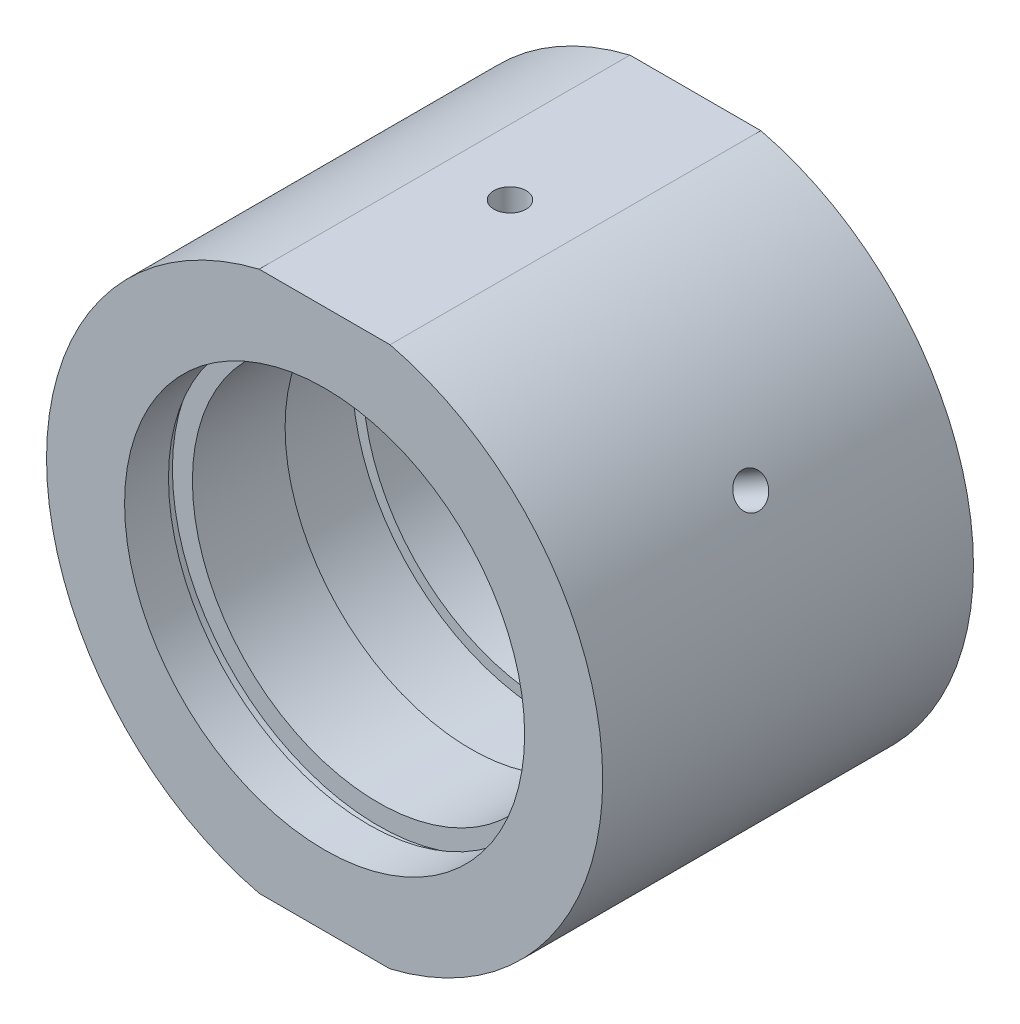
ISO-10303-21;
HEADER;
FILE_DESCRIPTION(('STEP AP214'),'2;1');
FILE_NAME('part.step','',(''),(''),'','','');
FILE_SCHEMA(('AUTOMOTIVE_DESIGN { 1 0 10303 214 1 1 1 1 }'));
ENDSEC;
DATA;
#1=APPLICATION_CONTEXT('core data for automotive mechanical design processes');
#2=APPLICATION_PROTOCOL_DEFINITION('international standard','automotive_design',2000,#1);
#3=PRODUCT_CONTEXT('',#1,'mechanical');
#4=PRODUCT('Part','Part','',(#3));
#5=PRODUCT_RELATED_PRODUCT_CATEGORY('part','',(#4));
#6=PRODUCT_DEFINITION_FORMATION('','',#4);
#7=PRODUCT_DEFINITION_CONTEXT('part definition',#1,'design');
#8=PRODUCT_DEFINITION('design','',#6,#7);
#9=PRODUCT_DEFINITION_SHAPE('','',#8);
#10=(LENGTH_UNIT() NAMED_UNIT(*) SI_UNIT(.MILLI.,.METRE.));
#11=(NAMED_UNIT(*) PLANE_ANGLE_UNIT() SI_UNIT($,.RADIAN.));
#12=(NAMED_UNIT(*) SI_UNIT($,.STERADIAN.) SOLID_ANGLE_UNIT());
#13=UNCERTAINTY_MEASURE_WITH_UNIT(LENGTH_MEASURE(1.E-05),#10,'distance_accuracy_value','');
#14=(GEOMETRIC_REPRESENTATION_CONTEXT(3) GLOBAL_UNCERTAINTY_ASSIGNED_CONTEXT((#13)) GLOBAL_UNIT_ASSIGNED_CONTEXT((#10,
#11,#12)) REPRESENTATION_CONTEXT('',''));
#15=CARTESIAN_POINT('',(0.,0.,0.));
#16=DIRECTION('',(0.,0.,1.));
#17=DIRECTION('',(1.,0.,0.));
#18=AXIS2_PLACEMENT_3D('',#15,#16,#17);
#19=CARTESIAN_POINT('',(-33.1519726534682,27.7,-30.));
#20=DIRECTION('',(0.,-1.,0.));
#21=DIRECTION('',(0.,0.,-1.));
#22=AXIS2_PLACEMENT_3D('',#19,#20,#21);
#23=PLANE('',#22);
#24=DIRECTION('',(-1.,0.,0.));
#25=VECTOR('',#24,1.);
#26=CARTESIAN_POINT('',(28.5,27.7,19.));
#27=LINE('',#26,#25);
#28=CARTESIAN_POINT('',(6.7052218456961,27.7,19.));
#29=VERTEX_POINT('',#28);
#30=CARTESIAN_POINT('',(-6.70522184569609,27.7,19.));
#31=VERTEX_POINT('',#30);
#32=EDGE_CURVE('E210',#29,#31,#27,.T.);
#33=ORIENTED_EDGE('',*,*,#32,.F.);
#34=DIRECTION('',(0.,0.,-1.));
#35=VECTOR('',#34,1.);
#36=CARTESIAN_POINT('',(6.70522184569613,27.7,-31.9390681003584));
#37=LINE('',#36,#35);
#38=CARTESIAN_POINT('',(6.70522184569614,27.7,-19.));
#39=VERTEX_POINT('',#38);
#40=EDGE_CURVE('E135',#39,#29,#37,.F.);
#41=ORIENTED_EDGE('',*,*,#40,.F.);
#42=DIRECTION('',(1.,0.,0.));
#43=VECTOR('',#42,1.);
#44=CARTESIAN_POINT('',(20.5,27.7,-19.));
#45=LINE('',#44,#43);
#46=CARTESIAN_POINT('',(-6.70522184569611,27.7,-19.));
#47=VERTEX_POINT('',#46);
#48=EDGE_CURVE('E139',#47,#39,#45,.T.);
#49=ORIENTED_EDGE('',*,*,#48,.F.);
#50=DIRECTION('',(0.,0.,-1.));
#51=VECTOR('',#50,1.);
#52=CARTESIAN_POINT('',(-6.70522184569613,27.7,-31.9390681003584));
#53=LINE('',#52,#51);
#54=EDGE_CURVE('E142',#31,#47,#53,.T.);
#55=ORIENTED_EDGE('',*,*,#54,.F.);
#56=EDGE_LOOP('',(#33,#41,#49,#55));
#57=FACE_BOUND('',#56,.T.);
#58=CARTESIAN_POINT('',(0.,27.7,0.));
#59=DIRECTION('',(0.,1.,0.));
#60=DIRECTION('',(0.,0.,1.));
#61=AXIS2_PLACEMENT_3D('',#58,#59,#60);
#62=CIRCLE('',#61,1.64999999999999);
#63=CARTESIAN_POINT('',(0.,27.7,1.64999999999999));
#64=VERTEX_POINT('',#63);
#65=EDGE_CURVE('E108',#64,#64,#62,.T.);
#66=ORIENTED_EDGE('',*,*,#65,.F.);
#67=EDGE_LOOP('',(#66));
#68=FACE_BOUND('',#67,.T.);
#69=ADVANCED_FACE('F44',(#57,#68),#23,.F.);
#70=CARTESIAN_POINT('',(0.,0.,-31.9390681003584));
#71=DIRECTION('',(0.,0.,-1.));
#72=DIRECTION('',(-1.,0.,0.));
#73=AXIS2_PLACEMENT_3D('',#70,#71,#72);
#74=CYLINDRICAL_SURFACE('',#73,28.5);
#75=CARTESIAN_POINT('',(23.8153251804841,15.6550402921169,0.));
#76=CARTESIAN_POINT('',(23.8153277749308,15.6550370795243,-0.092597859420851));
#77=CARTESIAN_POINT('',(23.8196314005314,15.648495501609,-0.185260883687119));
#78=CARTESIAN_POINT('',(23.8367053720121,15.6224745102445,-0.368029223496934));
#79=CARTESIAN_POINT('',(23.8494856204936,15.6029799647694,-0.458131418877639));
#80=CARTESIAN_POINT('',(23.883047908846,15.5515581135897,-0.633104162038933));
#81=CARTESIAN_POINT('',(23.9038257819432,15.5196372818995,-0.717977407442436));
#82=CARTESIAN_POINT('',(23.9526385469314,15.4441935848521,-0.880112571888857));
#83=CARTESIAN_POINT('',(23.9806717568717,15.4006734084152,-0.957376249277916));
#84=CARTESIAN_POINT('',(24.0430562144596,15.3030975605881,-1.10222274019426));
#85=CARTESIAN_POINT('',(24.0774147044993,15.249029808035,-1.16979429691297));
#86=CARTESIAN_POINT('',(24.1512594901974,15.1318027254734,-1.29324222428016));
#87=CARTESIAN_POINT('',(24.1907459978167,15.0686430196475,-1.34911811125169));
#88=CARTESIAN_POINT('',(24.2735675116473,14.9348620430341,-1.44762184788487));
#89=CARTESIAN_POINT('',(24.3169051374035,14.8642356871119,-1.49024058992059));
#90=CARTESIAN_POINT('',(24.4060146047625,14.7174662889455,-1.56096188486543));
#91=CARTESIAN_POINT('',(24.4517864233173,14.6413232989326,-1.5890645751916));
#92=CARTESIAN_POINT('',(24.5442958347122,14.485707503826,-1.62992536658154));
#93=CARTESIAN_POINT('',(24.5910322755923,14.4062385658194,-1.64270080242911));
#94=CARTESIAN_POINT('',(24.6841374618097,14.2461199296046,-1.65259795617058));
#95=CARTESIAN_POINT('',(24.7305062107939,14.1654702431304,-1.64971982952273));
#96=CARTESIAN_POINT('',(24.8215140418881,14.0053886164006,-1.62840588898168));
#97=CARTESIAN_POINT('',(24.8661551305039,13.9259553324555,-1.60998872611445));
#98=CARTESIAN_POINT('',(24.9525779635914,13.7705035188194,-1.55814843979012));
#99=CARTESIAN_POINT('',(24.9943596930856,13.6944850070158,-1.52472523773762));
#100=CARTESIAN_POINT('',(25.074039297685,13.5480446573406,-1.4438004575266));
#101=CARTESIAN_POINT('',(25.1119348175524,13.4776262191303,-1.39629040910615));
#102=CARTESIAN_POINT('',(25.1829180740113,13.3445245637642,-1.28854674262332));
#103=CARTESIAN_POINT('',(25.216005764436,13.2818414208868,-1.2283130023963));
#104=CARTESIAN_POINT('',(25.276680390478,13.1660062212325,-1.0967263901019));
#105=CARTESIAN_POINT('',(25.3042591835338,13.1128682844896,-1.02535733248248));
#106=CARTESIAN_POINT('',(25.3532699045685,13.0178559055621,-0.873582757263184));
#107=CARTESIAN_POINT('',(25.3747018304519,12.9759814672176,-0.793177236582501));
#108=CARTESIAN_POINT('',(25.4109837632356,12.9047862721655,-0.625601997467239));
#109=CARTESIAN_POINT('',(25.4258334645658,12.8754660982736,-0.538431965220726));
#110=CARTESIAN_POINT('',(25.4486562491563,12.8302977764119,-0.35980676827847));
#111=CARTESIAN_POINT('',(25.4566294017861,12.8144494925396,-0.268351646819872));
#112=CARTESIAN_POINT('',(25.465538390234,12.7967360980451,-0.0838944493383069));
#113=CARTESIAN_POINT('',(25.4664844223332,12.794850727388,0.00910518900747123));
#114=CARTESIAN_POINT('',(25.4613479608896,12.8050689748372,0.194136416173909));
#115=CARTESIAN_POINT('',(25.4552654986569,12.8171725306264,0.286168009305118));
#116=CARTESIAN_POINT('',(25.4361958173778,12.8549751225273,0.466586842761185));
#117=CARTESIAN_POINT('',(25.4232133159397,12.880664869599,0.554976528647749));
#118=CARTESIAN_POINT('',(25.3905999866401,12.9448337250359,0.725677915191171));
#119=CARTESIAN_POINT('',(25.3709691070619,12.9833129328883,0.80798956856187));
#120=CARTESIAN_POINT('',(25.325426555806,13.0719258258635,0.964302442341511));
#121=CARTESIAN_POINT('',(25.299507674783,13.1220728857392,1.03829397999782));
#122=CARTESIAN_POINT('',(25.2419427594548,13.2324672925696,1.17576878931791));
#123=CARTESIAN_POINT('',(25.2102966767578,13.2927147248668,1.23925197218311));
#124=CARTESIAN_POINT('',(25.1419318668708,13.4215713534383,1.35398434922265));
#125=CARTESIAN_POINT('',(25.1052071503995,13.490190411028,1.40521890087996));
#126=CARTESIAN_POINT('',(25.0275705469147,13.6336846873921,1.49389949694828));
#127=CARTESIAN_POINT('',(24.9866586827456,13.7085598720337,1.53134561658169));
#128=CARTESIAN_POINT('',(24.9016885882841,13.8623089314004,1.59136086739739));
#129=CARTESIAN_POINT('',(24.8576323454282,13.9411802713268,1.61393930515066));
#130=CARTESIAN_POINT('',(24.7675098427044,14.1006681486337,1.64360873795478));
#131=CARTESIAN_POINT('',(24.7214435992881,14.1812846717273,1.65069985974244));
#132=CARTESIAN_POINT('',(24.6286511043687,14.3418314405987,1.64919216160151));
#133=CARTESIAN_POINT('',(24.5819259168648,14.4217625177426,1.64061627710614));
#134=CARTESIAN_POINT('',(24.4891127337376,14.578809299921,1.60806550316041));
#135=CARTESIAN_POINT('',(24.4430247392691,14.6559249998534,1.58409058580486));
#136=CARTESIAN_POINT('',(24.3528909190879,14.805212368933,1.52142731292838));
#137=CARTESIAN_POINT('',(24.3088450919138,14.8773840416183,1.48273896793731));
#138=CARTESIAN_POINT('',(24.2241909586552,15.014829187217,1.39175049167336));
#139=CARTESIAN_POINT('',(24.1835825570162,15.0801028518958,1.33945073893903));
#140=CARTESIAN_POINT('',(24.1070787364025,15.2021036707577,1.22264007363981));
#141=CARTESIAN_POINT('',(24.071189757745,15.2588191613504,1.15811276186068));
#142=CARTESIAN_POINT('',(24.0053942654022,15.3621225072457,1.01869728937212));
#143=CARTESIAN_POINT('',(23.9754892210139,15.4087078754379,0.943806591650796));
#144=CARTESIAN_POINT('',(23.9226815656073,15.4905677684456,0.78571519859832));
#145=CARTESIAN_POINT('',(23.8997869013468,15.5258294592687,0.702505213408071));
#146=CARTESIAN_POINT('',(23.8618810776424,15.5840254408833,0.530265646202624));
#147=CARTESIAN_POINT('',(23.846860654162,15.6069742185544,0.441243042086118));
#148=CARTESIAN_POINT('',(23.8291633179954,15.6339733166283,0.293060355475163));
#149=CARTESIAN_POINT('',(23.82398218144,15.6418641270648,0.234858919179985));
#150=CARTESIAN_POINT('',(23.8170622895183,15.6523986335215,0.11778044436587));
#151=CARTESIAN_POINT('',(23.815323530103,15.6550423357132,0.0589034066416477));
#152=CARTESIAN_POINT('',(23.8153251804841,15.6550402921169,0.));
#153=B_SPLINE_CURVE_WITH_KNOTS('',3,(#75,#76,#77,#78,#79,#80,#81,#82,#83,#84,#85,#86,#87,#88,
#89,#90,#91,#92,#93,#94,#95,#96,#97,#98,#99,#100,#101,#102,#103,#104,#105,#106,#107,#108,#109,
#110,#111,#112,#113,#114,#115,#116,#117,#118,#119,#120,#121,#122,#123,#124,#125,#126,#127,#128,
#129,#130,#131,#132,#133,#134,#135,#136,#137,#138,#139,#140,#141,#142,#143,#144,#145,#146,#147,
#148,#149,#150,#151,#152),.UNSPECIFIED.,.T.,.F.,(4,2,2,2,2,2,2,2,2,2,2,2,2,2,2,2,2,2,2,2,2,2,2,
2,2,2,2,2,2,2,2,2,2,2,2,2,2,2,4),(0.,0.277578549691203,0.555481946042686,0.833240749883357,
1.11093522055068,1.38894964922939,1.66697557298441,1.94519208016563,2.22340595354618,
2.50130487570952,2.77920103801549,3.05676412385137,3.33432866346456,3.61206043913668,
3.88979488153024,4.16793684700295,4.44607890730275,4.72423387859202,5.00238604386324,
5.28013453415685,5.55788178715731,5.83543938610869,6.11299914418812,6.39087864776977,
6.66876049939252,6.94697289965536,7.22518378211567,7.50322034978582,7.78125464220031,
8.05888223740868,8.33651033571792,8.61413823533925,8.8917584148457,9.16975359929353,
9.44781695923019,9.72619436646001,10.0042435237498,10.1808171672527,10.3573906030721),.UNSPECIFIED.);
#154=CARTESIAN_POINT('',(23.8153251804841,15.6550402921169,0.));
#155=VERTEX_POINT('',#154);
#156=EDGE_CURVE('E11',#155,#155,#153,.T.);
#157=ORIENTED_EDGE('',*,*,#156,.T.);
#158=EDGE_LOOP('',(#157));
#159=FACE_BOUND('',#158,.T.);
#160=CARTESIAN_POINT('',(0.,0.,19.));
#161=DIRECTION('',(0.,0.,-1.));
#162=DIRECTION('',(-1.,0.,0.));
#163=AXIS2_PLACEMENT_3D('',#160,#161,#162);
#164=CIRCLE('',#163,28.5);
#165=CARTESIAN_POINT('',(6.7052218456961,-27.7,19.));
#166=VERTEX_POINT('',#165);
#167=EDGE_CURVE('E201',#29,#166,#164,.T.);
#168=ORIENTED_EDGE('',*,*,#167,.T.);
#169=DIRECTION('',(0.,0.,-1.));
#170=VECTOR('',#169,1.);
#171=CARTESIAN_POINT('',(6.70522184569613,-27.7,-31.9390681003584));
#172=LINE('',#171,#170);
#173=CARTESIAN_POINT('',(6.70522184569611,-27.7,-19.));
#174=VERTEX_POINT('',#173);
#175=EDGE_CURVE('E65',#166,#174,#172,.T.);
#176=ORIENTED_EDGE('',*,*,#175,.T.);
#177=CARTESIAN_POINT('',(0.,0.,-19.));
#178=DIRECTION('',(0.,0.,-1.));
#179=DIRECTION('',(-1.,0.,0.));
#180=AXIS2_PLACEMENT_3D('',#177,#178,#179);
#181=CIRCLE('',#180,28.5);
#182=EDGE_CURVE('E206',#39,#174,#181,.T.);
#183=ORIENTED_EDGE('',*,*,#182,.F.);
#184=ORIENTED_EDGE('',*,*,#40,.T.);
#185=EDGE_LOOP('',(#168,#176,#183,#184));
#186=FACE_BOUND('',#185,.T.);
#187=ADVANCED_FACE('F275',(#159,#186),#74,.T.);
#188=CARTESIAN_POINT('',(20.5,0.,-19.));
#189=DIRECTION('',(0.,0.,1.));
#190=DIRECTION('',(1.,0.,0.));
#191=AXIS2_PLACEMENT_3D('',#188,#189,#190);
#192=PLANE('',#191);
#193=CARTESIAN_POINT('',(0.,0.,-19.));
#194=DIRECTION('',(0.,0.,-1.));
#195=DIRECTION('',(-1.,0.,0.));
#196=AXIS2_PLACEMENT_3D('',#193,#194,#195);
#197=CIRCLE('',#196,20.5);
#198=CARTESIAN_POINT('',(-20.5,0.,-19.));
#199=VERTEX_POINT('',#198);
#200=EDGE_CURVE('E145',#199,#199,#197,.T.);
#201=ORIENTED_EDGE('',*,*,#200,.F.);
#202=EDGE_LOOP('',(#201));
#203=FACE_BOUND('',#202,.T.);
#204=ORIENTED_EDGE('',*,*,#182,.T.);
#205=DIRECTION('',(-1.,0.,0.));
#206=VECTOR('',#205,1.);
#207=CARTESIAN_POINT('',(20.5,-27.7,-19.));
#208=LINE('',#207,#206);
#209=CARTESIAN_POINT('',(-6.70522184569613,-27.7,-19.));
#210=VERTEX_POINT('',#209);
#211=EDGE_CURVE('E129',#174,#210,#208,.T.);
#212=ORIENTED_EDGE('',*,*,#211,.T.);
#213=EDGE_CURVE('E205',#210,#47,#181,.T.);
#214=ORIENTED_EDGE('',*,*,#213,.T.);
#215=ORIENTED_EDGE('',*,*,#48,.T.);
#216=EDGE_LOOP('',(#204,#212,#214,#215));
#217=FACE_BOUND('',#216,.T.);
#218=ADVANCED_FACE('F46',(#203,#217),#192,.F.);
#219=CARTESIAN_POINT('',(-25.4653251804841,12.7971564596282,0.));
#220=CARTESIAN_POINT('',(-25.4653236955207,12.7971603127813,-0.0925978594208509));
#221=CARTESIAN_POINT('',(-25.4618103356655,12.8041581508374,-0.185260883687119));
#222=CARTESIAN_POINT('',(-25.4478124818525,12.8319551395655,-0.368029223496933));
#223=CARTESIAN_POINT('',(-25.4373198344766,12.8527704321546,-0.458131418877638));
#224=CARTESIAN_POINT('',(-25.4095683492215,12.9075471520668,-0.633104162038933));
#225=CARTESIAN_POINT('',(-25.3923130346165,12.9415017338507,-0.717977407442436));
#226=CARTESIAN_POINT('',(-25.3513832589122,13.0214966768832,-0.880112571888858));
#227=CARTESIAN_POINT('',(-25.3277102855108,13.0675342370595,-0.957376249277916));
#228=CARTESIAN_POINT('',(-25.2743993512906,13.1703486860455,-1.10222274019426));
#229=CARTESIAN_POINT('',(-25.2447545490739,13.2271378875321,-1.16979429691297));
#230=CARTESIAN_POINT('',(-25.1801553104131,13.3497028891645,-1.29324222428016));
#231=CARTESIAN_POINT('',(-25.145200654482,13.4154790607825,-1.34911811125169));
#232=CARTESIAN_POINT('',(-25.070753687107,13.5540950840463,-1.44762184788487));
#233=CARTESIAN_POINT('',(-25.0312582815798,13.626939746852,-1.49024058992059));
#234=CARTESIAN_POINT('',(-24.948706987949,13.7774955083858,-1.56096188486543));
#235=CARTESIAN_POINT('',(-24.9056511335551,13.8552065610382,-1.5890645751916));
#236=CARTESIAN_POINT('',(-24.8171386074601,14.0131299589486,-1.62992536658154));
#237=CARTESIAN_POINT('',(-24.7716847087747,14.0933393730365,-1.64270080242911));
#238=CARTESIAN_POINT('',(-24.679570495302,14.2540301476322,-1.65259795617058));
#239=CARTESIAN_POINT('',(-24.6329101925002,14.3345115054314,-1.64971982952273));
#240=CARTESIAN_POINT('',(-24.5397793526202,14.4933674124672,-1.62840588898168));
#241=CARTESIAN_POINT('',(-24.4933086551257,14.5717443712336,-1.60998872611445));
#242=CARTESIAN_POINT('',(-24.4018948519962,14.7243146469725,-1.55814843979012));
#243=CARTESIAN_POINT('',(-24.3569517543635,14.7985079420303,-1.52472523773762));
#244=CARTESIAN_POINT('',(-24.2699704937053,14.9407326786145,-1.4438004575266));
#245=CARTESIAN_POINT('',(-24.2279340972541,15.0087603806144,-1.39629040910615));
#246=CARTESIAN_POINT('',(-24.1481563106508,15.1367845116342,-1.28854674262332));
#247=CARTESIAN_POINT('',(-24.1104149617422,15.1967808635333,-1.2283130023963));
#248=CARTESIAN_POINT('',(-24.0404360492101,15.3072442308779,-1.0967263901019));
#249=CARTESIAN_POINT('',(-24.008206642614,15.3576971346413,-1.02535733248249));
#250=CARTESIAN_POINT('',(-23.9504288693062,15.447647853579,-0.873582757263184));
#251=CARTESIAN_POINT('',(-23.9248805048723,15.4871456650183,-0.7931772365825));
#252=CARTESIAN_POINT('',(-23.8813646237216,15.5541643380334,-0.625601997467238));
#253=CARTESIAN_POINT('',(-23.863397458953,15.5816846435699,-0.538431965220725));
#254=CARTESIAN_POINT('',(-23.8356919370697,15.6240339157413,-0.35980676827847));
#255=CARTESIAN_POINT('',(-23.8259534969448,15.6388630104031,-0.268351646819872));
#256=CARTESIAN_POINT('',(-23.8150677415492,15.6554351179682,-0.0838944493383072));
#257=CARTESIAN_POINT('',(-23.8139079787142,15.6571970911275,0.0091051890074712));
#258=CARTESIAN_POINT('',(-23.8201890098656,15.6476396613071,0.194136416173909));
#259=CARTESIAN_POINT('',(-23.8276297655388,15.6363203166015,0.286168009305118));
#260=CARTESIAN_POINT('',(-23.8508329298143,15.6009041922212,0.466586842761185));
#261=CARTESIAN_POINT('',(-23.8665896526762,15.5768161426353,0.554976528647749));
#262=CARTESIAN_POINT('',(-23.9058548469666,15.5164877432414,0.725677915191172));
#263=CARTESIAN_POINT('',(-23.9293633786951,15.4802472989019,0.807989568561871));
#264=CARTESIAN_POINT('',(-23.9833331194865,15.3964998460735,0.964302442341513));
#265=CARTESIAN_POINT('',(-24.0138023067524,15.3489799067321,1.03829397999782));
#266=CARTESIAN_POINT('',(-24.0806242098392,15.243930024276,1.17576878931791));
#267=CARTESIAN_POINT('',(-24.1169769753729,15.1863999965815,1.23925197218312));
#268=CARTESIAN_POINT('',(-24.1943876842183,15.0627660202087,1.35398434922265));
#269=CARTESIAN_POINT('',(-24.2354511730391,14.9966519540029,1.40521890087996));
#270=CARTESIAN_POINT('',(-24.3209025599257,14.8576695449395,1.49389949694828));
#271=CARTESIAN_POINT('',(-24.3652904398538,14.7848012389321,1.53134561658169));
#272=CARTESIAN_POINT('',(-24.4559559838425,14.6343404488831,1.59136086739739));
#273=CARTESIAN_POINT('',(-24.5022324464214,14.5567509534114,1.61393930515066));
#274=CARTESIAN_POINT('',(-24.5952917484029,14.3989586379466,1.64360873795478));
#275=CARTESIAN_POINT('',(-24.6420745836586,14.3187558393443,1.65069985974244));
#276=CARTESIAN_POINT('',(-24.734715916537,14.1581217970279,1.64919216160151));
#277=CARTESIAN_POINT('',(-24.7805756661436,14.077691059081,1.64061627710614));
#278=CARTESIAN_POINT('',(-24.8701755775291,13.9187890935975,1.60806550316041));
#279=CARTESIAN_POINT('',(-24.9139157354669,13.840317869612,1.58409058580486));
#280=CARTESIAN_POINT('',(-24.9981354794634,13.6876160070553,1.52142731292838));
#281=CARTESIAN_POINT('',(-25.0386150678554,13.6133853654491,1.48273896793731));
#282=CARTESIAN_POINT('',(-25.1153189889414,13.4713501627124,1.39175049167336));
#283=CARTESIAN_POINT('',(-25.1515434399318,13.4035454229466,1.33945073893903));
#284=CARTESIAN_POINT('',(-25.218947338042,13.2762907613776,1.22264007363981));
#285=CARTESIAN_POINT('',(-25.2501199043546,13.216852248848,1.15811276186068));
#286=CARTESIAN_POINT('',(-25.3066854800245,13.108220008077,1.01869728937212));
#287=CARTESIAN_POINT('',(-25.3320770701294,13.0590287958393,0.943806591650794));
#288=CARTESIAN_POINT('',(-25.3765659893218,12.972366078239,0.785715198598317));
#289=CARTESIAN_POINT('',(-25.3956561772248,12.9349078719668,0.702505213408068));
#290=CARTESIAN_POINT('',(-25.427102463849,12.8729824748801,0.530265646202622));
#291=CARTESIAN_POINT('',(-25.4394664765578,12.848500017735,0.441243042086116));
#292=CARTESIAN_POINT('',(-25.4539997132857,12.8196741259984,0.293060355475163));
#293=CARTESIAN_POINT('',(-25.4582427873025,12.8112417249027,0.234858919179985));
#294=CARTESIAN_POINT('',(-25.4639059915494,12.7999816694787,0.11778044436587));
#295=CARTESIAN_POINT('',(-25.4653261250999,12.7971540085582,0.0589034066416476));
#296=CARTESIAN_POINT('',(-25.4653251804841,12.7971564596282,0.));
#297=B_SPLINE_CURVE_WITH_KNOTS('',3,(#219,#220,#221,#222,#223,#224,#225,#226,#227,#228,#229,
#230,#231,#232,#233,#234,#235,#236,#237,#238,#239,#240,#241,#242,#243,#244,#245,#246,#247,#248,
#249,#250,#251,#252,#253,#254,#255,#256,#257,#258,#259,#260,#261,#262,#263,#264,#265,#266,#267,
#268,#269,#270,#271,#272,#273,#274,#275,#276,#277,#278,#279,#280,#281,#282,#283,#284,#285,#286,
#287,#288,#289,#290,#291,#292,#293,#294,#295,#296),.UNSPECIFIED.,.T.,.F.,(4,2,2,2,2,2,2,2,2,2,2,
2,2,2,2,2,2,2,2,2,2,2,2,2,2,2,2,2,2,2,2,2,2,2,2,2,2,2,4),(0.,0.277578549691203,
0.555481946042686,0.833240749883359,1.11093522055068,1.38894964922939,1.66697557298441,
1.94519208016563,2.22340595354617,2.50130487570952,2.77920103801548,3.05676412385137,
3.33432866346457,3.61206043913668,3.88979488153024,4.16793684700295,4.44607890730275,
4.72423387859202,5.00238604386324,5.28013453415685,5.55788178715731,5.83543938610869,
6.11299914418812,6.39087864776977,6.66876049939252,6.94697289965537,7.22518378211567,
7.50322034978582,7.78125464220031,8.05888223740868,8.33651033571792,8.61413823533925,
8.8917584148457,9.16975359929354,9.44781695923019,9.72619436646001,10.0042435237498,
10.1808171672527,10.3573906030721),.UNSPECIFIED.);
#298=CARTESIAN_POINT('',(-25.4653251804841,12.7971564596282,0.));
#299=VERTEX_POINT('',#298);
#300=EDGE_CURVE('E233',#299,#299,#297,.T.);
#301=ORIENTED_EDGE('',*,*,#300,.T.);
#302=EDGE_LOOP('',(#301));
#303=FACE_BOUND('',#302,.T.);
#304=ORIENTED_EDGE('',*,*,#213,.F.);
#305=DIRECTION('',(0.,0.,-1.));
#306=VECTOR('',#305,1.);
#307=CARTESIAN_POINT('',(-6.70522184569613,-27.7,-31.9390681003584));
#308=LINE('',#307,#306);
#309=CARTESIAN_POINT('',(-6.70522184569609,-27.7,19.));
#310=VERTEX_POINT('',#309);
#311=EDGE_CURVE('E126',#210,#310,#308,.F.);
#312=ORIENTED_EDGE('',*,*,#311,.T.);
#313=EDGE_CURVE('E73',#310,#31,#164,.T.);
#314=ORIENTED_EDGE('',*,*,#313,.T.);
#315=ORIENTED_EDGE('',*,*,#54,.T.);
#316=EDGE_LOOP('',(#304,#312,#314,#315));
#317=FACE_BOUND('',#316,.T.);
#318=ADVANCED_FACE('F218',(#303,#317),#74,.T.);
#319=CARTESIAN_POINT('',(28.5,0.,19.));
#320=DIRECTION('',(0.,0.,-1.));
#321=DIRECTION('',(-1.,0.,0.));
#322=AXIS2_PLACEMENT_3D('',#319,#320,#321);
#323=PLANE('',#322);
#324=ORIENTED_EDGE('',*,*,#313,.F.);
#325=DIRECTION('',(1.,0.,0.));
#326=VECTOR('',#325,1.);
#327=CARTESIAN_POINT('',(28.5,-27.7,19.));
#328=LINE('',#327,#326);
#329=EDGE_CURVE('E58',#310,#166,#328,.T.);
#330=ORIENTED_EDGE('',*,*,#329,.T.);
#331=ORIENTED_EDGE('',*,*,#167,.F.);
#332=ORIENTED_EDGE('',*,*,#32,.T.);
#333=EDGE_LOOP('',(#324,#330,#331,#332));
#334=FACE_BOUND('',#333,.T.);
#335=CARTESIAN_POINT('',(0.,0.,19.));
#336=DIRECTION('',(0.,0.,-1.));
#337=DIRECTION('',(-1.,0.,0.));
#338=AXIS2_PLACEMENT_3D('',#335,#336,#337);
#339=CIRCLE('',#338,20.5);
#340=CARTESIAN_POINT('',(-20.5,0.,19.));
#341=VERTEX_POINT('',#340);
#342=EDGE_CURVE('E197',#341,#341,#339,.T.);
#343=ORIENTED_EDGE('',*,*,#342,.T.);
#344=EDGE_LOOP('',(#343));
#345=FACE_BOUND('',#344,.T.);
#346=ADVANCED_FACE('F267',(#334,#345),#323,.F.);
#347=CARTESIAN_POINT('',(0.,0.,-31.9390681003584));
#348=DIRECTION('',(0.,0.,-1.));
#349=DIRECTION('',(-1.,0.,0.));
#350=AXIS2_PLACEMENT_3D('',#347,#348,#349);
#351=CYLINDRICAL_SURFACE('',#350,20.5);
#352=ORIENTED_EDGE('',*,*,#342,.F.);
#353=EDGE_LOOP('',(#352));
#354=FACE_BOUND('',#353,.T.);
#355=CARTESIAN_POINT('',(0.,0.,14.5));
#356=DIRECTION('',(0.,0.,-1.));
#357=DIRECTION('',(-1.,0.,0.));
#358=AXIS2_PLACEMENT_3D('',#355,#356,#357);
#359=CIRCLE('',#358,20.5);
#360=CARTESIAN_POINT('',(-20.5,0.,14.5));
#361=VERTEX_POINT('',#360);
#362=EDGE_CURVE('E193',#361,#361,#359,.T.);
#363=ORIENTED_EDGE('',*,*,#362,.T.);
#364=EDGE_LOOP('',(#363));
#365=FACE_BOUND('',#364,.T.);
#366=ADVANCED_FACE('F264',(#354,#365),#351,.F.);
#367=CARTESIAN_POINT('',(20.5,0.,14.5));
#368=DIRECTION('',(0.,0.,1.));
#369=DIRECTION('',(1.,0.,0.));
#370=AXIS2_PLACEMENT_3D('',#367,#368,#369);
#371=PLANE('',#370);
#372=ORIENTED_EDGE('',*,*,#362,.F.);
#373=EDGE_LOOP('',(#372));
#374=FACE_BOUND('',#373,.T.);
#375=CARTESIAN_POINT('',(0.,0.,14.5));
#376=DIRECTION('',(0.,0.,-1.));
#377=DIRECTION('',(-1.,0.,0.));
#378=AXIS2_PLACEMENT_3D('',#375,#376,#377);
#379=CIRCLE('',#378,21.1);
#380=CARTESIAN_POINT('',(-21.1,0.,14.5));
#381=VERTEX_POINT('',#380);
#382=EDGE_CURVE('E189',#381,#381,#379,.T.);
#383=ORIENTED_EDGE('',*,*,#382,.T.);
#384=EDGE_LOOP('',(#383));
#385=FACE_BOUND('',#384,.T.);
#386=ADVANCED_FACE('F260',(#374,#385),#371,.F.);
#387=CARTESIAN_POINT('',(0.,0.,-31.9390681003584));
#388=DIRECTION('',(0.,0.,-1.));
#389=DIRECTION('',(-1.,0.,0.));
#390=AXIS2_PLACEMENT_3D('',#387,#388,#389);
#391=CYLINDRICAL_SURFACE('',#390,21.1);
#392=ORIENTED_EDGE('',*,*,#382,.F.);
#393=EDGE_LOOP('',(#392));
#394=FACE_BOUND('',#393,.T.);
#395=CARTESIAN_POINT('',(0.,0.,13.5));
#396=DIRECTION('',(0.,0.,-1.));
#397=DIRECTION('',(-1.,0.,0.));
#398=AXIS2_PLACEMENT_3D('',#395,#396,#397);
#399=CIRCLE('',#398,21.1);
#400=CARTESIAN_POINT('',(-21.1,0.,13.5));
#401=VERTEX_POINT('',#400);
#402=EDGE_CURVE('E185',#401,#401,#399,.T.);
#403=ORIENTED_EDGE('',*,*,#402,.T.);
#404=EDGE_LOOP('',(#403));
#405=FACE_BOUND('',#404,.T.);
#406=ADVANCED_FACE('F256',(#394,#405),#391,.F.);
#407=CARTESIAN_POINT('',(21.1,0.,13.5));
#408=DIRECTION('',(0.,0.,-1.));
#409=DIRECTION('',(-1.,0.,0.));
#410=AXIS2_PLACEMENT_3D('',#407,#408,#409);
#411=PLANE('',#410);
#412=ORIENTED_EDGE('',*,*,#402,.F.);
#413=EDGE_LOOP('',(#412));
#414=FACE_BOUND('',#413,.T.);
#415=CARTESIAN_POINT('',(0.,0.,13.5));
#416=DIRECTION('',(0.,0.,-1.));
#417=DIRECTION('',(-1.,0.,0.));
#418=AXIS2_PLACEMENT_3D('',#415,#416,#417);
#419=CIRCLE('',#418,19.05);
#420=CARTESIAN_POINT('',(-19.05,0.,13.5));
#421=VERTEX_POINT('',#420);
#422=EDGE_CURVE('E181',#421,#421,#419,.T.);
#423=ORIENTED_EDGE('',*,*,#422,.T.);
#424=EDGE_LOOP('',(#423));
#425=FACE_BOUND('',#424,.T.);
#426=ADVANCED_FACE('F252',(#414,#425),#411,.F.);
#427=CARTESIAN_POINT('',(0.,0.,-31.9390681003584));
#428=DIRECTION('',(0.,0.,-1.));
#429=DIRECTION('',(-1.,0.,0.));
#430=AXIS2_PLACEMENT_3D('',#427,#428,#429);
#431=CYLINDRICAL_SURFACE('',#430,19.05);
#432=ORIENTED_EDGE('',*,*,#422,.F.);
#433=EDGE_LOOP('',(#432));
#434=FACE_BOUND('',#433,.T.);
#435=CARTESIAN_POINT('',(0.,0.,4.));
#436=DIRECTION('',(0.,0.,-1.));
#437=DIRECTION('',(-1.,0.,0.));
#438=AXIS2_PLACEMENT_3D('',#435,#436,#437);
#439=CIRCLE('',#438,19.05);
#440=CARTESIAN_POINT('',(-19.05,0.,4.));
#441=VERTEX_POINT('',#440);
#442=EDGE_CURVE('E177',#441,#441,#439,.T.);
#443=ORIENTED_EDGE('',*,*,#442,.T.);
#444=EDGE_LOOP('',(#443));
#445=FACE_BOUND('',#444,.T.);
#446=ADVANCED_FACE('F248',(#434,#445),#431,.F.);
#447=CARTESIAN_POINT('',(19.05,0.,4.));
#448=DIRECTION('',(0.,0.,1.));
#449=DIRECTION('',(1.,0.,0.));
#450=AXIS2_PLACEMENT_3D('',#447,#448,#449);
#451=PLANE('',#450);
#452=ORIENTED_EDGE('',*,*,#442,.F.);
#453=EDGE_LOOP('',(#452));
#454=FACE_BOUND('',#453,.T.);
#455=CARTESIAN_POINT('',(0.,0.,4.));
#456=DIRECTION('',(0.,0.,-1.));
#457=DIRECTION('',(-1.,0.,0.));
#458=AXIS2_PLACEMENT_3D('',#455,#456,#457);
#459=CIRCLE('',#458,20.15);
#460=CARTESIAN_POINT('',(-20.15,0.,4.));
#461=VERTEX_POINT('',#460);
#462=EDGE_CURVE('E173',#461,#461,#459,.T.);
#463=ORIENTED_EDGE('',*,*,#462,.T.);
#464=EDGE_LOOP('',(#463));
#465=FACE_BOUND('',#464,.T.);
#466=ADVANCED_FACE('F242',(#454,#465),#451,.F.);
#467=CARTESIAN_POINT('',(0.,0.,-31.9390681003584));
#468=DIRECTION('',(0.,0.,-1.));
#469=DIRECTION('',(-1.,0.,0.));
#470=AXIS2_PLACEMENT_3D('',#467,#468,#469);
#471=CYLINDRICAL_SURFACE('',#470,20.15);
#472=CARTESIAN_POINT('',(-18.216808416608,8.61222335477884,0.));
#473=CARTESIAN_POINT('',(-18.2168071717094,8.61222730548485,0.0925143759811275));
#474=CARTESIAN_POINT('',(-18.2134645141771,8.61930750036369,0.185091875761764));
#475=CARTESIAN_POINT('',(-18.2001329981117,8.64742109177869,0.367685787677287));
#476=CARTESIAN_POINT('',(-18.1901365926905,8.66847033236071,0.457699170479255));
#477=CARTESIAN_POINT('',(-18.1636511344035,8.7238302026295,0.632493822109133));
#478=CARTESIAN_POINT('',(-18.1471657423378,8.75813335484332,0.717278009877318));
#479=CARTESIAN_POINT('',(-18.1079671408111,8.83889308801043,0.879252633503249));
#480=CARTESIAN_POINT('',(-18.0852552701704,8.88534705619119,0.956444696980381));
#481=CARTESIAN_POINT('',(-18.0339280319583,8.98906475398761,1.10125591015014));
#482=CARTESIAN_POINT('',(-18.0052997781153,9.04635205578128,1.16885361129772));
#483=CARTESIAN_POINT('',(-17.9426947286032,9.16989593747247,1.29237302908199));
#484=CARTESIAN_POINT('',(-17.9087177002172,9.23615290760904,1.34829423744585));
#485=CARTESIAN_POINT('',(-17.8360505949508,9.37571264935142,1.44694431345598));
#486=CARTESIAN_POINT('',(-17.7973540094767,9.44902512092919,1.48965466893052));
#487=CARTESIAN_POINT('',(-17.71615157623,9.60040849311726,1.56055223096122));
#488=CARTESIAN_POINT('',(-17.673645793103,9.67847931296674,1.58873968392989));
#489=CARTESIAN_POINT('',(-17.585971954807,9.83688274702673,1.62972968782682));
#490=CARTESIAN_POINT('',(-17.5408101364341,9.91720984811717,1.64256688047848));
#491=CARTESIAN_POINT('',(-17.4489480772331,10.0779600723713,1.65259904373962));
#492=CARTESIAN_POINT('',(-17.4022478641434,10.1583831937785,1.64979429623333));
#493=CARTESIAN_POINT('',(-17.3087709252889,10.3168500072012,1.62865054494948));
#494=CARTESIAN_POINT('',(-17.2619946512654,10.3948989407572,1.6103487938979));
#495=CARTESIAN_POINT('',(-17.1696858574897,10.5466716150568,1.55878847073778));
#496=CARTESIAN_POINT('',(-17.1241533492294,10.6203953158442,1.52552976048227));
#497=CARTESIAN_POINT('',(-17.0357480498084,10.7616330359521,1.44495804026483));
#498=CARTESIAN_POINT('',(-16.9928784925394,10.8291395513177,1.39762833082311));
#499=CARTESIAN_POINT('',(-16.9113056730202,10.9560915943942,1.2902702557445));
#500=CARTESIAN_POINT('',(-16.8726024923454,11.015536964278,1.23024164153786));
#501=CARTESIAN_POINT('',(-16.8006169116254,11.1250207312329,1.09897975583741));
#502=CARTESIAN_POINT('',(-16.7673507543522,11.175031007829,1.02771411696017));
#503=CARTESIAN_POINT('',(-16.7075964564866,11.26417372941,0.876113998459199));
#504=CARTESIAN_POINT('',(-16.6811083212062,11.3033061658697,0.795779511728011));
#505=CARTESIAN_POINT('',(-16.6359098996425,11.369723999364,0.628299466842711));
#506=CARTESIAN_POINT('',(-16.6172005260964,11.3970080061549,0.541153110827992));
#507=CARTESIAN_POINT('',(-16.588292396553,11.4390433113809,0.362533859638642));
#508=CARTESIAN_POINT('',(-16.5780934678756,11.453794864104,0.27106105228904));
#509=CARTESIAN_POINT('',(-16.5666264189945,11.4703745561771,0.0866695714065173));
#510=CARTESIAN_POINT('',(-16.5653324746885,11.4722400646039,-0.00624413748201938));
#511=CARTESIAN_POINT('',(-16.571658226347,11.4631005104668,-0.19112953722204));
#512=CARTESIAN_POINT('',(-16.5792778420768,11.4520955637554,-0.283101236545444));
#513=CARTESIAN_POINT('',(-16.6031126207604,11.4175122856666,-0.463362054967364));
#514=CARTESIAN_POINT('',(-16.6193158372836,11.3939514290038,-0.551656108749796));
#515=CARTESIAN_POINT('',(-16.6596815979082,11.3348481371687,-0.722208109064252));
#516=CARTESIAN_POINT('',(-16.6838442653956,11.299305516257,-0.804465962000009));
#517=CARTESIAN_POINT('',(-16.7392778457669,11.2170198569593,-0.960817803887209));
#518=CARTESIAN_POINT('',(-16.7705649399965,11.1702513084095,-1.03489262939069));
#519=CARTESIAN_POINT('',(-16.8390628414066,11.0667206167782,-1.17258207217326));
#520=CARTESIAN_POINT('',(-16.8762737470404,11.0099583075996,-1.23619651556606));
#521=CARTESIAN_POINT('',(-16.9553896268597,10.8877254360478,-1.35131382461082));
#522=CARTESIAN_POINT('',(-16.9973056425382,10.8222343193818,-1.40278728338109));
#523=CARTESIAN_POINT('',(-17.0843153561747,10.6843486287101,-1.49195975216877));
#524=CARTESIAN_POINT('',(-17.1294090233146,10.6119541216537,-1.52965889575273));
#525=CARTESIAN_POINT('',(-17.2212299452127,10.4622861370419,-1.59016204030671));
#526=CARTESIAN_POINT('',(-17.2679551278308,10.3850187545063,-1.61298425948634));
#527=CARTESIAN_POINT('',(-17.3616267846109,10.227648626743,-1.64314526541811));
#528=CARTESIAN_POINT('',(-17.4085732547273,10.1475459331792,-1.65048433414953));
#529=CARTESIAN_POINT('',(-17.5011657040039,9.9870046181263,-1.64946746949103));
#530=CARTESIAN_POINT('',(-17.5468150853713,9.9065676644983,-1.64115738008657));
#531=CARTESIAN_POINT('',(-17.6357092429086,9.7474390997817,-1.60917364960808));
#532=CARTESIAN_POINT('',(-17.6789540157216,9.66874749112968,-1.58549998708729));
#533=CARTESIAN_POINT('',(-17.7619505791788,9.51541997828316,-1.52347267953603));
#534=CARTESIAN_POINT('',(-17.8017025552251,9.44078385889838,-1.48511981427629));
#535=CARTESIAN_POINT('',(-17.8768076529871,9.29778357104177,-1.39482810906678));
#536=CARTESIAN_POINT('',(-17.9121608477229,9.22941929846179,-1.34288949468586));
#537=CARTESIAN_POINT('',(-17.9778303120726,9.10084351047085,-1.22672863886547));
#538=CARTESIAN_POINT('',(-18.0081322433314,9.040655289942,-1.16247250716413));
#539=CARTESIAN_POINT('',(-18.0630136609571,8.93050029776728,-1.023561106385));
#540=CARTESIAN_POINT('',(-18.0875917585868,8.88053600704441,-0.948903320627931));
#541=CARTESIAN_POINT('',(-18.1306293354538,8.79233757990831,-0.791167730369249));
#542=CARTESIAN_POINT('',(-18.1490775802495,8.75412499077274,-0.708074826229334));
#543=CARTESIAN_POINT('',(-18.1794791263306,8.69081604268442,-0.535994481105062));
#544=CARTESIAN_POINT('',(-18.1914399063475,8.66570458206565,-0.447013960745675));
#545=CARTESIAN_POINT('',(-18.2056419434715,8.63581257429337,-0.297922429589514));
#546=CARTESIAN_POINT('',(-18.2098260656707,8.62697964916442,-0.238770704545334));
#547=CARTESIAN_POINT('',(-18.2154097016018,8.61518376819815,-0.119754803131207));
#548=CARTESIAN_POINT('',(-18.2168092225127,8.6122207972275,-0.0598906285984251));
#549=CARTESIAN_POINT('',(-18.216808416608,8.61222335477884,0.));
#550=B_SPLINE_CURVE_WITH_KNOTS('',3,(#472,#473,#474,#475,#476,#477,#478,#479,#480,#481,#482,
#483,#484,#485,#486,#487,#488,#489,#490,#491,#492,#493,#494,#495,#496,#497,#498,#499,#500,#501,
#502,#503,#504,#505,#506,#507,#508,#509,#510,#511,#512,#513,#514,#515,#516,#517,#518,#519,#520,
#521,#522,#523,#524,#525,#526,#527,#528,#529,#530,#531,#532,#533,#534,#535,#536,#537,#538,#539,
#540,#541,#542,#543,#544,#545,#546,#547,#548,#549),.UNSPECIFIED.,.T.,.F.,(4,2,2,2,2,2,2,2,2,2,2,
2,2,2,2,2,2,2,2,2,2,2,2,2,2,2,2,2,2,2,2,2,2,2,2,2,2,2,4),(0.,0.277324458665704,
0.554964004592898,0.832447142508944,1.10987066260477,1.38790492095644,1.66595127950104,
1.94438551338994,2.22281502288312,2.5006149930804,2.77840995704621,3.05553902863923,
3.3326706599321,3.61013251335774,3.88759979835448,4.16588141951653,4.44416325877568,
4.72247774161202,5.0007865772115,5.27828798683278,5.55578689856235,5.83290060535935,
6.11001860812509,6.38777240612831,6.66553082085528,6.94395524454924,7.22237696835027,
7.50045709452483,7.77853215625764,8.05579386807383,8.33305596693383,8.61030333945799,
8.88754610904115,9.16556292310789,9.44364712051112,9.72223819907526,10.000507432308,
10.1800382219741,10.3595685487915),.UNSPECIFIED.);
#551=CARTESIAN_POINT('',(-18.216808416608,8.61222335477884,0.));
#552=VERTEX_POINT('',#551);
#553=EDGE_CURVE('E48',#552,#552,#550,.T.);
#554=ORIENTED_EDGE('',*,*,#553,.T.);
#555=EDGE_LOOP('',(#554));
#556=FACE_BOUND('',#555,.T.);
#557=CARTESIAN_POINT('',(16.566808416608,11.4701071872675,0.));
#558=CARTESIAN_POINT('',(16.5668112155705,11.4701041338006,0.0925143759811275));
#559=CARTESIAN_POINT('',(16.5712715154332,11.4636692100221,0.185091875761764));
#560=CARTESIAN_POINT('',(16.5889528417575,11.438066982731,0.367685787677287));
#561=CARTESIAN_POINT('',(16.6021838161212,11.4188852213987,0.457699170479255));
#562=CARTESIAN_POINT('',(16.6368841409807,11.3682682065569,0.632493822109133));
#563=CARTESIAN_POINT('',(16.6583488461949,11.3368398621297,0.717278009877317));
#564=CARTESIAN_POINT('',(16.7086895259572,11.2625130108312,0.879252633503248));
#565=CARTESIAN_POINT('',(16.7375639071879,11.2196169697985,0.956444696980381));
#566=CARTESIAN_POINT('',(16.8017224491957,11.1233074287026,1.10125591015015));
#567=CARTESIAN_POINT('',(16.8370205809417,11.0698709827117,1.16885361129772));
#568=CARTESIAN_POINT('',(16.9127101962124,10.9538814785835,1.29237302908199));
#569=CARTESIAN_POINT('',(16.9531019013354,10.8913280237878,1.34829423744585));
#570=CARTESIAN_POINT('',(17.0376306303967,10.7586165937364,1.44694431345598));
#571=CARTESIAN_POINT('',(17.0817728004603,10.6884481318872,1.48965466893052));
#572=CARTESIAN_POINT('',(17.1722734298623,10.5424330757524,1.56055223096122));
#573=CARTESIAN_POINT('',(17.2186318515827,10.466586577832,1.58873968392989));
#574=CARTESIAN_POINT('',(17.3119763303774,10.3114570895904,1.62972968782682));
#575=CARTESIAN_POINT('',(17.3589607313477,10.2321822570531,1.64256688047848));
#576=CARTESIAN_POINT('',(17.4522434796152,10.072252268014,1.65259904373962));
#577=CARTESIAN_POINT('',(17.4985418392607,9.99159713641264,1.64979429623333));
#578=CARTESIAN_POINT('',(17.5890396559143,9.83141032598527,1.62865054494948));
#579=CARTESIAN_POINT('',(17.6332438781003,9.75187641760847,1.6103487938979));
#580=CARTESIAN_POINT('',(17.7185284727562,9.5960483200562,1.55878847073778));
#581=CARTESIAN_POINT('',(17.7596088163689,9.51975416081116,1.52552976048227));
#582=CARTESIAN_POINT('',(17.8377216202445,9.37257406562937,1.44495804026483));
#583=CARTESIAN_POINT('',(17.8747491988376,9.30169468230267,1.39762833082311));
#584=CARTESIAN_POINT('',(17.9439064834445,9.16757452680243,1.2902702557445));
#585=CARTESIAN_POINT('',(17.9760360935639,9.1043339041889,1.23024164153786));
#586=CARTESIAN_POINT('',(18.0348590266889,8.98725067910179,1.09897975583741));
#587=CARTESIAN_POINT('',(18.0615361180347,8.93343620351889,1.02771411696017));
#588=CARTESIAN_POINT('',(18.1088588305536,8.83711610279141,0.8761139984592));
#589=CARTESIAN_POINT('',(18.1295044469995,8.79461048650992,0.795779511728012));
#590=CARTESIAN_POINT('',(18.164424767288,8.72225858847757,0.62829946684271));
#591=CARTESIAN_POINT('',(18.1786987235129,8.69241379230237,0.541153110827991));
#592=CARTESIAN_POINT('',(18.2006483009227,8.64636096512887,0.362533859638642));
#593=CARTESIAN_POINT('',(18.2083240559875,8.63015265744132,0.27106105228904));
#594=CARTESIAN_POINT('',(18.2169489660692,8.6119320557673,0.086669571406518));
#595=CARTESIAN_POINT('',(18.2179175716048,8.60987871291377,-0.00624413748201856));
#596=CARTESIAN_POINT('',(18.213165361372,8.61992675161667,-0.191129537222039));
#597=CARTESIAN_POINT('',(18.2074446058176,8.63202800576139,-0.283101236545444));
#598=CARTESIAN_POINT('',(18.1894119977883,8.66996116863941,-0.463362054967363));
#599=CARTESIAN_POINT('',(18.177109305645,8.69577399410291,-0.551656108749796));
#600=CARTESIAN_POINT('',(18.1461072337808,8.76028341416447,-0.722208109064252));
#601=CARTESIAN_POINT('',(18.1274077548979,8.79898020848757,-0.804465962000009));
#602=CARTESIAN_POINT('',(18.0838630737646,8.88812992696075,-0.960817803887209));
#603=CARTESIAN_POINT('',(18.0590038697372,8.93860961964903,-1.03489262939069));
#604=CARTESIAN_POINT('',(18.0035926114181,9.04969588819179,-1.17258207217326));
#605=CARTESIAN_POINT('',(17.9730404625089,9.11030263235774,-1.23619651556606));
#606=CARTESIAN_POINT('',(17.9067416304772,9.23993542989994,-1.35131382461082));
#607=CARTESIAN_POINT('',(17.8709826675614,9.308981322636,-1.40278728338109));
#608=CARTESIAN_POINT('',(17.7950750134396,9.45327679035705,-1.49195975216877));
#609=CARTESIAN_POINT('',(17.7549263648043,9.52852630517818,-1.52965889575273));
#610=CARTESIAN_POINT('',(17.6712205489463,9.68287954844666,-1.59016204030671));
#611=CARTESIAN_POINT('',(17.6276676240956,9.76197843485823,-1.61298425948634));
#612=CARTESIAN_POINT('',(17.5382169240459,9.92178553312604,-1.64314526541811));
#613=CARTESIAN_POINT('',(17.4923191915662,10.0024937156467,-1.65048433414953));
#614=CARTESIAN_POINT('',(17.3995825590117,10.1629517864453,-1.64946746949103));
#615=CARTESIAN_POINT('',(17.3527468044506,10.2427037871906,-1.64115738008657));
#616=CARTESIAN_POINT('',(17.2593845037069,10.3992526682242,-1.60917364960808));
#617=CARTESIAN_POINT('',(17.2128579579561,10.4760495443872,-1.58549998708729));
#618=CARTESIAN_POINT('',(17.1215707184605,10.6245904331911,-1.52347267953603));
#619=CARTESIAN_POINT('',(17.0768099310565,10.6963347139903,-1.48511981427629));
#620=CARTESIAN_POINT('',(16.9905205979052,10.8328777805342,-1.39482810906678));
#621=CARTESIAN_POINT('',(16.9489919985076,10.8976766815703,-1.34288949468586));
#622=CARTESIAN_POINT('',(16.8704768319707,11.0188359999456,-1.22672863886548));
#623=CARTESIAN_POINT('',(16.8335032696135,11.0751723524638,-1.16247250716413));
#624=CARTESIAN_POINT('',(16.7655469568494,11.1777785504107,-1.023561106385));
#625=CARTESIAN_POINT('',(16.7345656606162,11.2240459526962,-0.948903320627932));
#626=CARTESIAN_POINT('',(16.679702370576,11.3054168011484,-0.791167730369249));
#627=CARTESIAN_POINT('',(16.6558334200381,11.3404997443645,-0.708074826229334));
#628=CARTESIAN_POINT('',(16.6162070357472,11.3984827296292,-0.535994481105062));
#629=CARTESIAN_POINT('',(16.6004402629337,11.4213967992823,-0.447013960745675));
#630=CARTESIAN_POINT('',(16.5816540433948,11.4486421281033,-0.297922429589514));
#631=CARTESIAN_POINT('',(16.576096566943,11.4566821467848,-0.238770704545333));
#632=CARTESIAN_POINT('',(16.5686728523317,11.4674156578297,-0.119754803131206));
#633=CARTESIAN_POINT('',(16.5668066046559,11.470109163977,-0.059890628598425));
#634=CARTESIAN_POINT('',(16.566808416608,11.4701071872675,0.));
#635=B_SPLINE_CURVE_WITH_KNOTS('',3,(#557,#558,#559,#560,#561,#562,#563,#564,#565,#566,#567,
#568,#569,#570,#571,#572,#573,#574,#575,#576,#577,#578,#579,#580,#581,#582,#583,#584,#585,#586,
#587,#588,#589,#590,#591,#592,#593,#594,#595,#596,#597,#598,#599,#600,#601,#602,#603,#604,#605,
#606,#607,#608,#609,#610,#611,#612,#613,#614,#615,#616,#617,#618,#619,#620,#621,#622,#623,#624,
#625,#626,#627,#628,#629,#630,#631,#632,#633,#634),.UNSPECIFIED.,.T.,.F.,(4,2,2,2,2,2,2,2,2,2,2,
2,2,2,2,2,2,2,2,2,2,2,2,2,2,2,2,2,2,2,2,2,2,2,2,2,2,2,4),(0.,0.277324458665705,
0.554964004592898,0.832447142508943,1.10987066260477,1.38790492095644,1.66595127950104,
1.94438551338993,2.22281502288311,2.5006149930804,2.77840995704621,3.05553902863922,
3.3326706599321,3.61013251335774,3.88759979835447,4.16588141951652,4.44416325877568,
4.72247774161202,5.00078657721149,5.27828798683278,5.55578689856235,5.83290060535935,
6.11001860812509,6.38777240612831,6.66553082085528,6.94395524454924,7.22237696835027,
7.50045709452483,7.77853215625764,8.05579386807384,8.33305596693383,8.61030333945799,
8.88754610904115,9.16556292310789,9.44364712051112,9.72223819907526,10.000507432308,
10.1800382219741,10.3595685487916),.UNSPECIFIED.);
#636=CARTESIAN_POINT('',(16.566808416608,11.4701071872675,0.));
#637=VERTEX_POINT('',#636);
#638=EDGE_CURVE('E119',#637,#637,#635,.T.);
#639=ORIENTED_EDGE('',*,*,#638,.T.);
#640=EDGE_LOOP('',(#639));
#641=FACE_BOUND('',#640,.T.);
#642=ORIENTED_EDGE('',*,*,#462,.F.);
#643=EDGE_LOOP('',(#642));
#644=FACE_BOUND('',#643,.T.);
#645=CARTESIAN_POINT('',(0.,0.,-4.));
#646=DIRECTION('',(0.,0.,-1.));
#647=DIRECTION('',(-1.,0.,0.));
#648=AXIS2_PLACEMENT_3D('',#645,#646,#647);
#649=CIRCLE('',#648,20.15);
#650=CARTESIAN_POINT('',(-20.15,0.,-4.));
#651=VERTEX_POINT('',#650);
#652=EDGE_CURVE('E169',#651,#651,#649,.T.);
#653=ORIENTED_EDGE('',*,*,#652,.T.);
#654=EDGE_LOOP('',(#653));
#655=FACE_BOUND('',#654,.T.);
#656=ADVANCED_FACE('F236',(#556,#641,#644,#655),#471,.F.);
#657=CARTESIAN_POINT('',(20.15,0.,-4.));
#658=DIRECTION('',(0.,0.,-1.));
#659=DIRECTION('',(-1.,0.,0.));
#660=AXIS2_PLACEMENT_3D('',#657,#658,#659);
#661=PLANE('',#660);
#662=ORIENTED_EDGE('',*,*,#652,.F.);
#663=EDGE_LOOP('',(#662));
#664=FACE_BOUND('',#663,.T.);
#665=CARTESIAN_POINT('',(0.,0.,-4.));
#666=DIRECTION('',(0.,0.,-1.));
#667=DIRECTION('',(-1.,0.,0.));
#668=AXIS2_PLACEMENT_3D('',#665,#666,#667);
#669=CIRCLE('',#668,19.05);
#670=CARTESIAN_POINT('',(-19.05,0.,-4.));
#671=VERTEX_POINT('',#670);
#672=EDGE_CURVE('E165',#671,#671,#669,.T.);
#673=ORIENTED_EDGE('',*,*,#672,.T.);
#674=EDGE_LOOP('',(#673));
#675=FACE_BOUND('',#674,.T.);
#676=ADVANCED_FACE('F241',(#664,#675),#661,.F.);
#677=CARTESIAN_POINT('',(0.,0.,-31.9390681003584));
#678=DIRECTION('',(0.,0.,-1.));
#679=DIRECTION('',(-1.,0.,0.));
#680=AXIS2_PLACEMENT_3D('',#677,#678,#679);
#681=CYLINDRICAL_SURFACE('',#680,19.05);
#682=ORIENTED_EDGE('',*,*,#672,.F.);
#683=EDGE_LOOP('',(#682));
#684=FACE_BOUND('',#683,.T.);
#685=CARTESIAN_POINT('',(0.,0.,-13.5));
#686=DIRECTION('',(0.,0.,-1.));
#687=DIRECTION('',(-1.,0.,0.));
#688=AXIS2_PLACEMENT_3D('',#685,#686,#687);
#689=CIRCLE('',#688,19.05);
#690=CARTESIAN_POINT('',(-19.05,0.,-13.5));
#691=VERTEX_POINT('',#690);
#692=EDGE_CURVE('E161',#691,#691,#689,.T.);
#693=ORIENTED_EDGE('',*,*,#692,.T.);
#694=EDGE_LOOP('',(#693));
#695=FACE_BOUND('',#694,.T.);
#696=ADVANCED_FACE('F303',(#684,#695),#681,.F.);
#697=CARTESIAN_POINT('',(19.05,0.,-13.5));
#698=DIRECTION('',(0.,0.,1.));
#699=DIRECTION('',(1.,0.,0.));
#700=AXIS2_PLACEMENT_3D('',#697,#698,#699);
#701=PLANE('',#700);
#702=ORIENTED_EDGE('',*,*,#692,.F.);
#703=EDGE_LOOP('',(#702));
#704=FACE_BOUND('',#703,.T.);
#705=CARTESIAN_POINT('',(0.,0.,-13.5));
#706=DIRECTION('',(0.,0.,-1.));
#707=DIRECTION('',(-1.,0.,0.));
#708=AXIS2_PLACEMENT_3D('',#705,#706,#707);
#709=CIRCLE('',#708,21.1);
#710=CARTESIAN_POINT('',(-21.1,0.,-13.5));
#711=VERTEX_POINT('',#710);
#712=EDGE_CURVE('E157',#711,#711,#709,.T.);
#713=ORIENTED_EDGE('',*,*,#712,.T.);
#714=EDGE_LOOP('',(#713));
#715=FACE_BOUND('',#714,.T.);
#716=ADVANCED_FACE('F300',(#704,#715),#701,.F.);
#717=CARTESIAN_POINT('',(0.,0.,-31.9390681003584));
#718=DIRECTION('',(0.,0.,-1.));
#719=DIRECTION('',(-1.,0.,0.));
#720=AXIS2_PLACEMENT_3D('',#717,#718,#719);
#721=CYLINDRICAL_SURFACE('',#720,21.1);
#722=ORIENTED_EDGE('',*,*,#712,.F.);
#723=EDGE_LOOP('',(#722));
#724=FACE_BOUND('',#723,.T.);
#725=CARTESIAN_POINT('',(0.,0.,-14.5));
#726=DIRECTION('',(0.,0.,-1.));
#727=DIRECTION('',(-1.,0.,0.));
#728=AXIS2_PLACEMENT_3D('',#725,#726,#727);
#729=CIRCLE('',#728,21.1);
#730=CARTESIAN_POINT('',(-21.1,0.,-14.5));
#731=VERTEX_POINT('',#730);
#732=EDGE_CURVE('E153',#731,#731,#729,.T.);
#733=ORIENTED_EDGE('',*,*,#732,.T.);
#734=EDGE_LOOP('',(#733));
#735=FACE_BOUND('',#734,.T.);
#736=ADVANCED_FACE('F296',(#724,#735),#721,.F.);
#737=CARTESIAN_POINT('',(21.1,0.,-14.5));
#738=DIRECTION('',(0.,0.,-1.));
#739=DIRECTION('',(-1.,0.,0.));
#740=AXIS2_PLACEMENT_3D('',#737,#738,#739);
#741=PLANE('',#740);
#742=ORIENTED_EDGE('',*,*,#732,.F.);
#743=EDGE_LOOP('',(#742));
#744=FACE_BOUND('',#743,.T.);
#745=CARTESIAN_POINT('',(0.,0.,-14.5));
#746=DIRECTION('',(0.,0.,-1.));
#747=DIRECTION('',(-1.,0.,0.));
#748=AXIS2_PLACEMENT_3D('',#745,#746,#747);
#749=CIRCLE('',#748,20.5);
#750=CARTESIAN_POINT('',(-20.5,0.,-14.5));
#751=VERTEX_POINT('',#750);
#752=EDGE_CURVE('E149',#751,#751,#749,.T.);
#753=ORIENTED_EDGE('',*,*,#752,.T.);
#754=EDGE_LOOP('',(#753));
#755=FACE_BOUND('',#754,.T.);
#756=ADVANCED_FACE('F292',(#744,#755),#741,.F.);
#757=CARTESIAN_POINT('',(0.,0.,-31.9390681003584));
#758=DIRECTION('',(0.,0.,-1.));
#759=DIRECTION('',(-1.,0.,0.));
#760=AXIS2_PLACEMENT_3D('',#757,#758,#759);
#761=CYLINDRICAL_SURFACE('',#760,20.5);
#762=ORIENTED_EDGE('',*,*,#752,.F.);
#763=EDGE_LOOP('',(#762));
#764=FACE_BOUND('',#763,.T.);
#765=ORIENTED_EDGE('',*,*,#200,.T.);
#766=EDGE_LOOP('',(#765));
#767=FACE_BOUND('',#766,.T.);
#768=ADVANCED_FACE('F289',(#764,#767),#761,.F.);
#769=CARTESIAN_POINT('',(-33.1519726534682,-27.7,-30.));
#770=DIRECTION('',(0.,1.,0.));
#771=DIRECTION('',(0.,0.,1.));
#772=AXIS2_PLACEMENT_3D('',#769,#770,#771);
#773=PLANE('',#772);
#774=CARTESIAN_POINT('',(0.,-27.7,0.));
#775=DIRECTION('',(0.,-1.,0.));
#776=DIRECTION('',(0.,0.,-1.));
#777=AXIS2_PLACEMENT_3D('',#774,#775,#776);
#778=CIRCLE('',#777,2.5);
#779=CARTESIAN_POINT('',(0.,-27.7,-2.5));
#780=VERTEX_POINT('',#779);
#781=EDGE_CURVE('E109',#780,#780,#778,.T.);
#782=ORIENTED_EDGE('',*,*,#781,.F.);
#783=EDGE_LOOP('',(#782));
#784=FACE_BOUND('',#783,.T.);
#785=ORIENTED_EDGE('',*,*,#329,.F.);
#786=ORIENTED_EDGE('',*,*,#311,.F.);
#787=ORIENTED_EDGE('',*,*,#211,.F.);
#788=ORIENTED_EDGE('',*,*,#175,.F.);
#789=EDGE_LOOP('',(#785,#786,#787,#788));
#790=FACE_BOUND('',#789,.T.);
#791=ADVANCED_FACE('F287',(#784,#790),#773,.F.);
#792=CARTESIAN_POINT('',(0.,22.2,0.));
#793=DIRECTION('',(0.,1.,0.));
#794=DIRECTION('',(0.,0.,1.));
#795=AXIS2_PLACEMENT_3D('',#792,#793,#794);
#796=CONICAL_SURFACE('',#795,1.65,1.02974425867665);
#797=CARTESIAN_POINT('',(0.,21.2085799786045,0.));
#798=VERTEX_POINT('',#797);
#799=VERTEX_LOOP('',#798);
#800=FACE_BOUND('',#799,.T.);
#801=CARTESIAN_POINT('',(0.,22.2,0.));
#802=DIRECTION('',(0.,1.,0.));
#803=DIRECTION('',(0.,0.,1.));
#804=AXIS2_PLACEMENT_3D('',#801,#802,#803);
#805=CIRCLE('',#804,1.65);
#806=CARTESIAN_POINT('',(0.,22.2,1.65));
#807=VERTEX_POINT('',#806);
#808=EDGE_CURVE('E115',#807,#807,#805,.T.);
#809=ORIENTED_EDGE('',*,*,#808,.T.);
#810=EDGE_LOOP('',(#809));
#811=FACE_BOUND('',#810,.T.);
#812=ADVANCED_FACE('F333',(#800,#811),#796,.F.);
#813=CARTESIAN_POINT('',(0.,27.7,0.));
#814=DIRECTION('',(0.,1.,0.));
#815=DIRECTION('',(0.,0.,1.));
#816=AXIS2_PLACEMENT_3D('',#813,#814,#815);
#817=CYLINDRICAL_SURFACE('',#816,1.64999999999999);
#818=ORIENTED_EDGE('',*,*,#808,.F.);
#819=EDGE_LOOP('',(#818));
#820=FACE_BOUND('',#819,.T.);
#821=ORIENTED_EDGE('',*,*,#65,.T.);
#822=EDGE_LOOP('',(#821));
#823=FACE_BOUND('',#822,.T.);
#824=ADVANCED_FACE('F101',(#820,#823),#817,.F.);
#825=CARTESIAN_POINT('',(0.,-22.2,0.));
#826=DIRECTION('',(0.,-1.,0.));
#827=DIRECTION('',(0.,0.,-1.));
#828=AXIS2_PLACEMENT_3D('',#825,#826,#827);
#829=CONICAL_SURFACE('',#828,2.5,1.02974425867665);
#830=CARTESIAN_POINT('',(0.,-20.6978484524311,0.));
#831=VERTEX_POINT('',#830);
#832=VERTEX_LOOP('',#831);
#833=FACE_BOUND('',#832,.T.);
#834=CARTESIAN_POINT('',(0.,-22.2,0.));
#835=DIRECTION('',(0.,-1.,0.));
#836=DIRECTION('',(0.,0.,-1.));
#837=AXIS2_PLACEMENT_3D('',#834,#835,#836);
#838=CIRCLE('',#837,2.5);
#839=CARTESIAN_POINT('',(0.,-22.2,-2.5));
#840=VERTEX_POINT('',#839);
#841=EDGE_CURVE('E105',#840,#840,#838,.T.);
#842=ORIENTED_EDGE('',*,*,#841,.T.);
#843=EDGE_LOOP('',(#842));
#844=FACE_BOUND('',#843,.T.);
#845=ADVANCED_FACE('F97',(#833,#844),#829,.F.);
#846=CARTESIAN_POINT('',(0.,-27.7,0.));
#847=DIRECTION('',(0.,-1.,0.));
#848=DIRECTION('',(0.,0.,-1.));
#849=AXIS2_PLACEMENT_3D('',#846,#847,#848);
#850=CYLINDRICAL_SURFACE('',#849,2.5);
#851=ORIENTED_EDGE('',*,*,#841,.F.);
#852=EDGE_LOOP('',(#851));
#853=FACE_BOUND('',#852,.T.);
#854=ORIENTED_EDGE('',*,*,#781,.T.);
#855=EDGE_LOOP('',(#854));
#856=FACE_BOUND('',#855,.T.);
#857=ADVANCED_FACE('F100',(#853,#856),#850,.F.);
#858=CARTESIAN_POINT('',(24.6817240078564,14.2500000000001,0.));
#859=DIRECTION('',(0.866025403784436,0.500000000000004,0.));
#860=DIRECTION('',(-0.500000000000004,0.866025403784436,0.));
#861=AXIS2_PLACEMENT_3D('',#858,#859,#860);
#862=CYLINDRICAL_SURFACE('',#861,1.64999999999999);
#863=ORIENTED_EDGE('',*,*,#156,.F.);
#864=EDGE_LOOP('',(#863));
#865=FACE_BOUND('',#864,.T.);
#866=ORIENTED_EDGE('',*,*,#638,.F.);
#867=EDGE_LOOP('',(#866));
#868=FACE_BOUND('',#867,.T.);
#869=ADVANCED_FACE('F221',(#865,#868),#862,.F.);
#870=CARTESIAN_POINT('',(-24.6817240078564,14.2500000000001,0.));
#871=DIRECTION('',(-0.866025403784436,0.500000000000004,0.));
#872=DIRECTION('',(-0.500000000000004,-0.866025403784436,0.));
#873=AXIS2_PLACEMENT_3D('',#870,#871,#872);
#874=CYLINDRICAL_SURFACE('',#873,1.64999999999999);
#875=ORIENTED_EDGE('',*,*,#553,.F.);
#876=EDGE_LOOP('',(#875));
#877=FACE_BOUND('',#876,.T.);
#878=ORIENTED_EDGE('',*,*,#300,.F.);
#879=EDGE_LOOP('',(#878));
#880=FACE_BOUND('',#879,.T.);
#881=ADVANCED_FACE('F225',(#877,#880),#874,.F.);
#882=CLOSED_SHELL('',(#69,#187,#218,#318,#346,#366,#386,#406,#426,#446,#466,#656,#676,#696,#716,
#736,#756,#768,#791,#812,#824,#845,#857,#869,#881));
#883=MANIFOLD_SOLID_BREP('B2',#882);
#884=ADVANCED_BREP_SHAPE_REPRESENTATION('',(#18,#883),#14);
#885=SHAPE_DEFINITION_REPRESENTATION(#9,#884);
ENDSEC;
END-ISO-10303-21;
